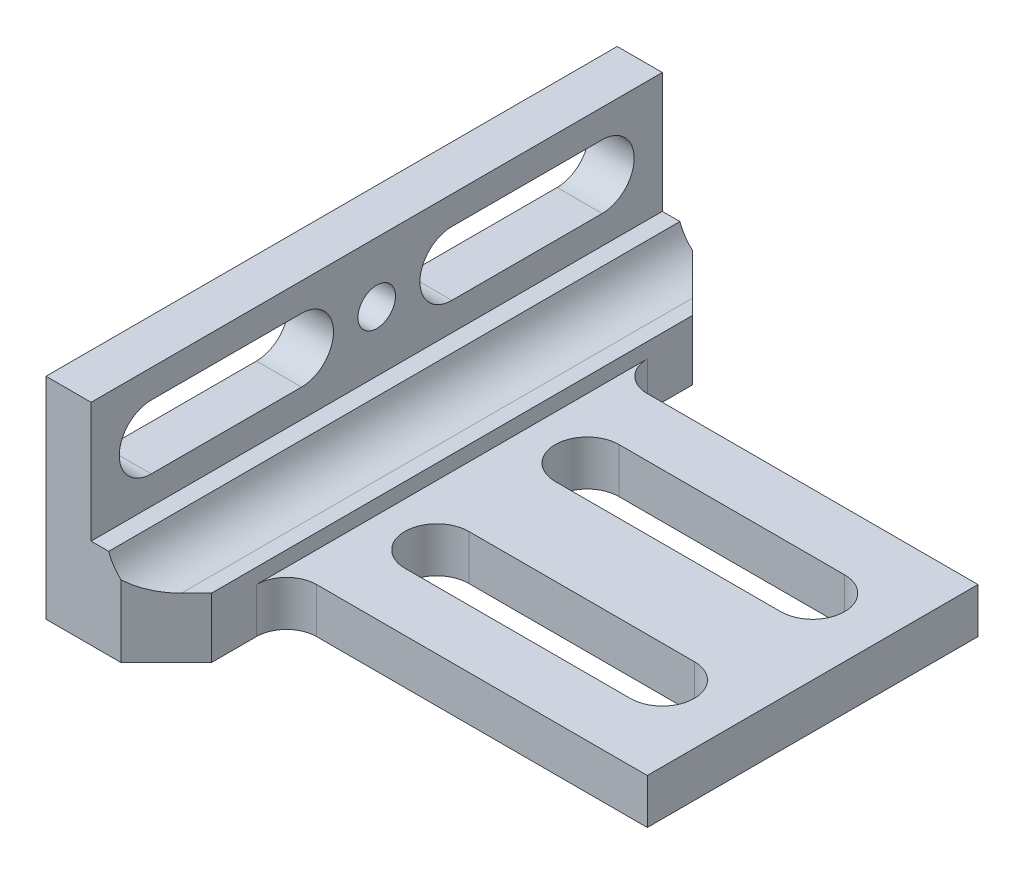
ISO-10303-21;
HEADER;
FILE_DESCRIPTION(('STEP AP214'),'2;1');
FILE_NAME('part.step','',(''),(''),'','','');
FILE_SCHEMA(('AUTOMOTIVE_DESIGN { 1 0 10303 214 1 1 1 1 }'));
ENDSEC;
DATA;
#1=APPLICATION_CONTEXT('core data for automotive mechanical design processes');
#2=APPLICATION_PROTOCOL_DEFINITION('international standard','automotive_design',2000,#1);
#3=PRODUCT_CONTEXT('',#1,'mechanical');
#4=PRODUCT('Part','Part','',(#3));
#5=PRODUCT_RELATED_PRODUCT_CATEGORY('part','',(#4));
#6=PRODUCT_DEFINITION_FORMATION('','',#4);
#7=PRODUCT_DEFINITION_CONTEXT('part definition',#1,'design');
#8=PRODUCT_DEFINITION('design','',#6,#7);
#9=PRODUCT_DEFINITION_SHAPE('','',#8);
#10=(LENGTH_UNIT() NAMED_UNIT(*) SI_UNIT(.MILLI.,.METRE.));
#11=(NAMED_UNIT(*) PLANE_ANGLE_UNIT() SI_UNIT($,.RADIAN.));
#12=(NAMED_UNIT(*) SI_UNIT($,.STERADIAN.) SOLID_ANGLE_UNIT());
#13=UNCERTAINTY_MEASURE_WITH_UNIT(LENGTH_MEASURE(1.E-05),#10,'distance_accuracy_value','');
#14=(GEOMETRIC_REPRESENTATION_CONTEXT(3) GLOBAL_UNCERTAINTY_ASSIGNED_CONTEXT((#13)) GLOBAL_UNIT_ASSIGNED_CONTEXT((#10,
#11,#12)) REPRESENTATION_CONTEXT('',''));
#15=CARTESIAN_POINT('',(0.,0.,0.));
#16=DIRECTION('',(0.,0.,1.));
#17=DIRECTION('',(1.,0.,0.));
#18=AXIS2_PLACEMENT_3D('',#15,#16,#17);
#19=CARTESIAN_POINT('',(9.52500000000001,47.625,60.325));
#20=DIRECTION('',(-1.,0.,0.));
#21=DIRECTION('',(0.,-1.,0.));
#22=AXIS2_PLACEMENT_3D('',#19,#20,#21);
#23=PLANE('',#22);
#24=CARTESIAN_POINT('',(9.525,31.75,15.875));
#25=DIRECTION('',(-1.,0.,0.));
#26=DIRECTION('',(0.,1.,0.));
#27=AXIS2_PLACEMENT_3D('',#24,#25,#26);
#28=CIRCLE('',#27,6.74687500000001);
#29=CARTESIAN_POINT('',(9.525,38.496875,15.875));
#30=VERTEX_POINT('',#29);
#31=CARTESIAN_POINT('',(9.525,25.003125,15.875));
#32=VERTEX_POINT('',#31);
#33=EDGE_CURVE('E367',#30,#32,#28,.T.);
#34=ORIENTED_EDGE('',*,*,#33,.T.);
#35=DIRECTION('',(0.,0.,1.));
#36=VECTOR('',#35,1.);
#37=CARTESIAN_POINT('',(9.525,25.003125,15.875));
#38=LINE('',#37,#36);
#39=CARTESIAN_POINT('',(9.525,25.003125,47.625));
#40=VERTEX_POINT('',#39);
#41=EDGE_CURVE('E371',#32,#40,#38,.T.);
#42=ORIENTED_EDGE('',*,*,#41,.T.);
#43=CARTESIAN_POINT('',(9.525,31.75,47.625));
#44=DIRECTION('',(-1.,0.,0.));
#45=DIRECTION('',(0.,1.,0.));
#46=AXIS2_PLACEMENT_3D('',#43,#44,#45);
#47=CIRCLE('',#46,6.74687500000001);
#48=CARTESIAN_POINT('',(9.525,38.496875,47.625));
#49=VERTEX_POINT('',#48);
#50=EDGE_CURVE('E384',#40,#49,#47,.T.);
#51=ORIENTED_EDGE('',*,*,#50,.T.);
#52=DIRECTION('',(0.,0.,-1.));
#53=VECTOR('',#52,1.);
#54=CARTESIAN_POINT('',(9.52500000000001,38.496875,15.875));
#55=LINE('',#54,#53);
#56=EDGE_CURVE('E381',#49,#30,#55,.T.);
#57=ORIENTED_EDGE('',*,*,#56,.T.);
#58=EDGE_LOOP('',(#34,#42,#51,#57));
#59=FACE_BOUND('',#58,.T.);
#60=DIRECTION('',(0.,0.,-1.));
#61=VECTOR('',#60,1.);
#62=CARTESIAN_POINT('',(9.525,25.003125,-15.875));
#63=LINE('',#62,#61);
#64=CARTESIAN_POINT('',(9.525,25.003125,-15.875));
#65=VERTEX_POINT('',#64);
#66=CARTESIAN_POINT('',(9.525,25.003125,-47.625));
#67=VERTEX_POINT('',#66);
#68=EDGE_CURVE('E414',#65,#67,#63,.T.);
#69=ORIENTED_EDGE('',*,*,#68,.F.);
#70=CARTESIAN_POINT('',(9.525,31.75,-15.875));
#71=DIRECTION('',(1.,0.,0.));
#72=DIRECTION('',(0.,1.,0.));
#73=AXIS2_PLACEMENT_3D('',#70,#71,#72);
#74=CIRCLE('',#73,6.74687500000001);
#75=CARTESIAN_POINT('',(9.52500000000001,38.496875,-15.875));
#76=VERTEX_POINT('',#75);
#77=EDGE_CURVE('E392',#76,#65,#74,.T.);
#78=ORIENTED_EDGE('',*,*,#77,.F.);
#79=DIRECTION('',(0.,0.,1.));
#80=VECTOR('',#79,1.);
#81=CARTESIAN_POINT('',(9.52500000000001,38.496875,-15.875));
#82=LINE('',#81,#80);
#83=CARTESIAN_POINT('',(9.525,38.496875,-47.625));
#84=VERTEX_POINT('',#83);
#85=EDGE_CURVE('E403',#84,#76,#82,.T.);
#86=ORIENTED_EDGE('',*,*,#85,.F.);
#87=CARTESIAN_POINT('',(9.525,31.75,-47.625));
#88=DIRECTION('',(1.,0.,0.));
#89=DIRECTION('',(0.,1.,0.));
#90=AXIS2_PLACEMENT_3D('',#87,#88,#89);
#91=CIRCLE('',#90,6.74687500000001);
#92=EDGE_CURVE('E417',#67,#84,#91,.T.);
#93=ORIENTED_EDGE('',*,*,#92,.F.);
#94=EDGE_LOOP('',(#69,#78,#86,#93));
#95=FACE_BOUND('',#94,.T.);
#96=DIRECTION('',(0.,0.,1.));
#97=VECTOR('',#96,1.);
#98=CARTESIAN_POINT('',(9.52500000000001,44.45,445.66342640527));
#99=LINE('',#98,#97);
#100=CARTESIAN_POINT('',(9.52500000000001,44.45,-60.325));
#101=VERTEX_POINT('',#100);
#102=CARTESIAN_POINT('',(9.52500000000001,44.45,60.325));
#103=VERTEX_POINT('',#102);
#104=EDGE_CURVE('E443',#101,#103,#99,.T.);
#105=ORIENTED_EDGE('',*,*,#104,.T.);
#106=DIRECTION('',(0.,1.,0.));
#107=VECTOR('',#106,1.);
#108=CARTESIAN_POINT('',(9.52500000000001,47.625,60.325));
#109=LINE('',#108,#107);
#110=CARTESIAN_POINT('',(9.525,19.05,60.325));
#111=VERTEX_POINT('',#110);
#112=EDGE_CURVE('E434',#111,#103,#109,.T.);
#113=ORIENTED_EDGE('',*,*,#112,.F.);
#114=DIRECTION('',(0.,0.,-1.));
#115=VECTOR('',#114,1.);
#116=CARTESIAN_POINT('',(9.525,19.05,60.325));
#117=LINE('',#116,#115);
#118=CARTESIAN_POINT('',(9.525,19.05,-60.325));
#119=VERTEX_POINT('',#118);
#120=EDGE_CURVE('E438',#111,#119,#117,.T.);
#121=ORIENTED_EDGE('',*,*,#120,.T.);
#122=DIRECTION('',(0.,1.,0.));
#123=VECTOR('',#122,1.);
#124=CARTESIAN_POINT('',(9.52500000000001,47.625,-60.325));
#125=LINE('',#124,#123);
#126=EDGE_CURVE('E435',#119,#101,#125,.T.);
#127=ORIENTED_EDGE('',*,*,#126,.T.);
#128=EDGE_LOOP('',(#105,#113,#121,#127));
#129=FACE_BOUND('',#128,.T.);
#130=CARTESIAN_POINT('',(9.52500000000001,31.75,0.));
#131=DIRECTION('',(1.,0.,0.));
#132=DIRECTION('',(0.,0.,-1.));
#133=AXIS2_PLACEMENT_3D('',#130,#131,#132);
#134=CIRCLE('',#133,3.96874999999999);
#135=CARTESIAN_POINT('',(9.52500000000001,31.75,-3.96874999999999));
#136=VERTEX_POINT('',#135);
#137=EDGE_CURVE('E357',#136,#136,#134,.T.);
#138=ORIENTED_EDGE('',*,*,#137,.F.);
#139=EDGE_LOOP('',(#138));
#140=FACE_BOUND('',#139,.T.);
#141=ADVANCED_FACE('F32',(#59,#95,#129,#140),#23,.F.);
#142=CARTESIAN_POINT('',(0.,0.,60.325));
#143=DIRECTION('',(1.,0.,0.));
#144=DIRECTION('',(0.,0.,-1.));
#145=AXIS2_PLACEMENT_3D('',#142,#143,#144);
#146=PLANE('',#145);
#147=CARTESIAN_POINT('',(0.,31.75,0.));
#148=DIRECTION('',(1.,0.,0.));
#149=DIRECTION('',(0.,0.,-1.));
#150=AXIS2_PLACEMENT_3D('',#147,#148,#149);
#151=CIRCLE('',#150,3.96874999999999);
#152=CARTESIAN_POINT('',(0.,31.75,-3.96874999999999));
#153=VERTEX_POINT('',#152);
#154=EDGE_CURVE('E354',#153,#153,#151,.T.);
#155=ORIENTED_EDGE('',*,*,#154,.T.);
#156=EDGE_LOOP('',(#155));
#157=FACE_BOUND('',#156,.T.);
#158=DIRECTION('',(0.,0.,1.));
#159=VECTOR('',#158,1.);
#160=CARTESIAN_POINT('',(0.,44.45,60.325));
#161=LINE('',#160,#159);
#162=CARTESIAN_POINT('',(0.,44.45,-60.325));
#163=VERTEX_POINT('',#162);
#164=CARTESIAN_POINT('',(0.,44.45,60.325));
#165=VERTEX_POINT('',#164);
#166=EDGE_CURVE('E504',#163,#165,#161,.T.);
#167=ORIENTED_EDGE('',*,*,#166,.F.);
#168=DIRECTION('',(0.,-1.,0.));
#169=VECTOR('',#168,1.);
#170=CARTESIAN_POINT('',(0.,0.,-60.325));
#171=LINE('',#170,#169);
#172=CARTESIAN_POINT('',(0.,0.,-60.325));
#173=VERTEX_POINT('',#172);
#174=EDGE_CURVE('E334',#163,#173,#171,.T.);
#175=ORIENTED_EDGE('',*,*,#174,.T.);
#176=DIRECTION('',(0.,0.,-1.));
#177=VECTOR('',#176,1.);
#178=CARTESIAN_POINT('',(0.,0.,60.325));
#179=LINE('',#178,#177);
#180=CARTESIAN_POINT('',(0.,0.,60.325));
#181=VERTEX_POINT('',#180);
#182=EDGE_CURVE('E277',#181,#173,#179,.T.);
#183=ORIENTED_EDGE('',*,*,#182,.F.);
#184=DIRECTION('',(0.,-1.,0.));
#185=VECTOR('',#184,1.);
#186=CARTESIAN_POINT('',(0.,0.,60.325));
#187=LINE('',#186,#185);
#188=EDGE_CURVE('E331',#165,#181,#187,.T.);
#189=ORIENTED_EDGE('',*,*,#188,.F.);
#190=EDGE_LOOP('',(#167,#175,#183,#189));
#191=FACE_BOUND('',#190,.T.);
#192=DIRECTION('',(0.,0.,1.));
#193=VECTOR('',#192,1.);
#194=CARTESIAN_POINT('',(0.,38.496875,-15.875));
#195=LINE('',#194,#193);
#196=CARTESIAN_POINT('',(0.,38.496875,-47.625));
#197=VERTEX_POINT('',#196);
#198=CARTESIAN_POINT('',(0.,38.496875,-15.875));
#199=VERTEX_POINT('',#198);
#200=EDGE_CURVE('E409',#197,#199,#195,.T.);
#201=ORIENTED_EDGE('',*,*,#200,.T.);
#202=CARTESIAN_POINT('',(0.,31.75,-15.875));
#203=DIRECTION('',(1.,0.,0.));
#204=DIRECTION('',(0.,1.,0.));
#205=AXIS2_PLACEMENT_3D('',#202,#203,#204);
#206=CIRCLE('',#205,6.74687500000001);
#207=CARTESIAN_POINT('',(0.,25.003125,-15.875));
#208=VERTEX_POINT('',#207);
#209=EDGE_CURVE('E399',#199,#208,#206,.T.);
#210=ORIENTED_EDGE('',*,*,#209,.T.);
#211=DIRECTION('',(0.,0.,-1.));
#212=VECTOR('',#211,1.);
#213=CARTESIAN_POINT('',(0.,25.003125,-15.875));
#214=LINE('',#213,#212);
#215=CARTESIAN_POINT('',(0.,25.003125,-47.625));
#216=VERTEX_POINT('',#215);
#217=EDGE_CURVE('E402',#208,#216,#214,.T.);
#218=ORIENTED_EDGE('',*,*,#217,.T.);
#219=CARTESIAN_POINT('',(0.,31.75,-47.625));
#220=DIRECTION('',(1.,0.,0.));
#221=DIRECTION('',(0.,1.,0.));
#222=AXIS2_PLACEMENT_3D('',#219,#220,#221);
#223=CIRCLE('',#222,6.74687500000001);
#224=EDGE_CURVE('E406',#216,#197,#223,.T.);
#225=ORIENTED_EDGE('',*,*,#224,.T.);
#226=EDGE_LOOP('',(#201,#210,#218,#225));
#227=FACE_BOUND('',#226,.T.);
#228=CARTESIAN_POINT('',(0.,31.75,15.875));
#229=DIRECTION('',(-1.,0.,0.));
#230=DIRECTION('',(0.,1.,0.));
#231=AXIS2_PLACEMENT_3D('',#228,#229,#230);
#232=CIRCLE('',#231,6.74687500000001);
#233=CARTESIAN_POINT('',(0.,38.496875,15.875));
#234=VERTEX_POINT('',#233);
#235=CARTESIAN_POINT('',(0.,25.003125,15.875));
#236=VERTEX_POINT('',#235);
#237=EDGE_CURVE('E368',#234,#236,#232,.T.);
#238=ORIENTED_EDGE('',*,*,#237,.F.);
#239=DIRECTION('',(0.,0.,-1.));
#240=VECTOR('',#239,1.);
#241=CARTESIAN_POINT('',(0.,38.496875,15.875));
#242=LINE('',#241,#240);
#243=CARTESIAN_POINT('',(0.,38.496875,47.625));
#244=VERTEX_POINT('',#243);
#245=EDGE_CURVE('E370',#244,#234,#242,.T.);
#246=ORIENTED_EDGE('',*,*,#245,.F.);
#247=CARTESIAN_POINT('',(0.,31.75,47.625));
#248=DIRECTION('',(-1.,0.,0.));
#249=DIRECTION('',(0.,1.,0.));
#250=AXIS2_PLACEMENT_3D('',#247,#248,#249);
#251=CIRCLE('',#250,6.74687500000001);
#252=CARTESIAN_POINT('',(0.,25.003125,47.625));
#253=VERTEX_POINT('',#252);
#254=EDGE_CURVE('E373',#253,#244,#251,.T.);
#255=ORIENTED_EDGE('',*,*,#254,.F.);
#256=DIRECTION('',(0.,0.,1.));
#257=VECTOR('',#256,1.);
#258=CARTESIAN_POINT('',(0.,25.003125,15.875));
#259=LINE('',#258,#257);
#260=EDGE_CURVE('E376',#236,#253,#259,.T.);
#261=ORIENTED_EDGE('',*,*,#260,.F.);
#262=EDGE_LOOP('',(#238,#246,#255,#261));
#263=FACE_BOUND('',#262,.T.);
#264=ADVANCED_FACE('F528',(#157,#191,#227,#263),#146,.F.);
#265=CARTESIAN_POINT('',(101.6,0.,60.325));
#266=DIRECTION('',(0.,1.,0.));
#267=DIRECTION('',(0.,0.,1.));
#268=AXIS2_PLACEMENT_3D('',#265,#266,#267);
#269=PLANE('',#268);
#270=DIRECTION('',(0.,0.,-1.));
#271=VECTOR('',#270,1.);
#272=CARTESIAN_POINT('',(25.4,0.,60.325));
#273=LINE('',#272,#271);
#274=CARTESIAN_POINT('',(25.4,0.,50.8));
#275=VERTEX_POINT('',#274);
#276=CARTESIAN_POINT('',(25.4,0.,41.275));
#277=VERTEX_POINT('',#276);
#278=EDGE_CURVE('E255',#275,#277,#273,.T.);
#279=ORIENTED_EDGE('',*,*,#278,.F.);
#280=DIRECTION('',(0.707106781186546,0.,-0.707106781186549));
#281=VECTOR('',#280,1.);
#282=CARTESIAN_POINT('',(15.875,0.,60.325));
#283=LINE('',#282,#281);
#284=CARTESIAN_POINT('',(15.875,0.,60.325));
#285=VERTEX_POINT('',#284);
#286=EDGE_CURVE('E40',#275,#285,#283,.F.);
#287=ORIENTED_EDGE('',*,*,#286,.T.);
#288=DIRECTION('',(1.,0.,0.));
#289=VECTOR('',#288,1.);
#290=CARTESIAN_POINT('',(101.6,0.,60.325));
#291=LINE('',#290,#289);
#292=EDGE_CURVE('E323',#181,#285,#291,.T.);
#293=ORIENTED_EDGE('',*,*,#292,.F.);
#294=ORIENTED_EDGE('',*,*,#182,.T.);
#295=DIRECTION('',(1.,0.,0.));
#296=VECTOR('',#295,1.);
#297=CARTESIAN_POINT('',(101.6,0.,-60.325));
#298=LINE('',#297,#296);
#299=CARTESIAN_POINT('',(15.875,0.,-60.325));
#300=VERTEX_POINT('',#299);
#301=EDGE_CURVE('E516',#173,#300,#298,.T.);
#302=ORIENTED_EDGE('',*,*,#301,.T.);
#303=DIRECTION('',(0.707106781186548,0.,0.707106781186547));
#304=VECTOR('',#303,1.);
#305=CARTESIAN_POINT('',(25.4,0.,-50.8));
#306=LINE('',#305,#304);
#307=CARTESIAN_POINT('',(25.4,0.,-50.8));
#308=VERTEX_POINT('',#307);
#309=EDGE_CURVE('E318',#300,#308,#306,.T.);
#310=ORIENTED_EDGE('',*,*,#309,.T.);
#311=DIRECTION('',(0.,0.,-1.));
#312=VECTOR('',#311,1.);
#313=CARTESIAN_POINT('',(25.4,0.,-60.325));
#314=LINE('',#313,#312);
#315=CARTESIAN_POINT('',(25.4,0.,-41.275));
#316=VERTEX_POINT('',#315);
#317=EDGE_CURVE('E352',#316,#308,#314,.T.);
#318=ORIENTED_EDGE('',*,*,#317,.F.);
#319=CARTESIAN_POINT('',(31.75,0.,-41.275));
#320=DIRECTION('',(0.,1.,0.));
#321=DIRECTION('',(0.,0.,1.));
#322=AXIS2_PLACEMENT_3D('',#319,#320,#321);
#323=CIRCLE('',#322,6.35);
#324=CARTESIAN_POINT('',(31.75,0.,-34.925));
#325=VERTEX_POINT('',#324);
#326=EDGE_CURVE('E294',#316,#325,#323,.T.);
#327=ORIENTED_EDGE('',*,*,#326,.T.);
#328=DIRECTION('',(1.,0.,0.));
#329=VECTOR('',#328,1.);
#330=CARTESIAN_POINT('',(-1.72721189138315,0.,-34.925));
#331=LINE('',#330,#329);
#332=CARTESIAN_POINT('',(101.6,0.,-34.925));
#333=VERTEX_POINT('',#332);
#334=EDGE_CURVE('E269',#325,#333,#331,.T.);
#335=ORIENTED_EDGE('',*,*,#334,.T.);
#336=DIRECTION('',(0.,0.,-1.));
#337=VECTOR('',#336,1.);
#338=CARTESIAN_POINT('',(101.6,0.,60.325));
#339=LINE('',#338,#337);
#340=CARTESIAN_POINT('',(101.6,0.,34.925));
#341=VERTEX_POINT('',#340);
#342=EDGE_CURVE('E261',#341,#333,#339,.T.);
#343=ORIENTED_EDGE('',*,*,#342,.F.);
#344=DIRECTION('',(1.,0.,0.));
#345=VECTOR('',#344,1.);
#346=CARTESIAN_POINT('',(-1.72721189138315,0.,34.925));
#347=LINE('',#346,#345);
#348=CARTESIAN_POINT('',(31.75,0.,34.925));
#349=VERTEX_POINT('',#348);
#350=EDGE_CURVE('E242',#349,#341,#347,.T.);
#351=ORIENTED_EDGE('',*,*,#350,.F.);
#352=CARTESIAN_POINT('',(31.75,0.,41.275));
#353=DIRECTION('',(0.,1.,0.));
#354=DIRECTION('',(0.,0.,1.));
#355=AXIS2_PLACEMENT_3D('',#352,#353,#354);
#356=CIRCLE('',#355,6.35);
#357=EDGE_CURVE('E301',#349,#277,#356,.T.);
#358=ORIENTED_EDGE('',*,*,#357,.T.);
#359=EDGE_LOOP('',(#279,#287,#293,#294,#302,#310,#318,#327,#335,#343,#351,#358));
#360=FACE_BOUND('',#359,.T.);
#361=DIRECTION('',(1.,0.,0.));
#362=VECTOR('',#361,1.);
#363=CARTESIAN_POINT('',(38.1,0.,-9.12875999999999));
#364=LINE('',#363,#362);
#365=CARTESIAN_POINT('',(38.1,0.,-9.12875999999999));
#366=VERTEX_POINT('',#365);
#367=CARTESIAN_POINT('',(85.725,0.,-9.12876));
#368=VERTEX_POINT('',#367);
#369=EDGE_CURVE('E497',#366,#368,#364,.T.);
#370=ORIENTED_EDGE('',*,*,#369,.T.);
#371=CARTESIAN_POINT('',(85.725,0.,-15.875));
#372=DIRECTION('',(0.,1.,0.));
#373=DIRECTION('',(0.,0.,1.));
#374=AXIS2_PLACEMENT_3D('',#371,#372,#373);
#375=CIRCLE('',#374,6.74624);
#376=CARTESIAN_POINT('',(85.725,0.,-22.62124));
#377=VERTEX_POINT('',#376);
#378=EDGE_CURVE('E480',#368,#377,#375,.T.);
#379=ORIENTED_EDGE('',*,*,#378,.T.);
#380=DIRECTION('',(-1.,0.,0.));
#381=VECTOR('',#380,1.);
#382=CARTESIAN_POINT('',(85.725,0.,-22.62124));
#383=LINE('',#382,#381);
#384=CARTESIAN_POINT('',(38.1,0.,-22.62124));
#385=VERTEX_POINT('',#384);
#386=EDGE_CURVE('E491',#377,#385,#383,.T.);
#387=ORIENTED_EDGE('',*,*,#386,.T.);
#388=CARTESIAN_POINT('',(38.1,0.,-15.875));
#389=DIRECTION('',(0.,1.,0.));
#390=DIRECTION('',(0.,0.,1.));
#391=AXIS2_PLACEMENT_3D('',#388,#389,#390);
#392=CIRCLE('',#391,6.74624000000001);
#393=EDGE_CURVE('E494',#385,#366,#392,.T.);
#394=ORIENTED_EDGE('',*,*,#393,.T.);
#395=EDGE_LOOP('',(#370,#379,#387,#394));
#396=FACE_BOUND('',#395,.T.);
#397=CARTESIAN_POINT('',(85.725,0.,15.875));
#398=DIRECTION('',(0.,-1.,0.));
#399=DIRECTION('',(0.,0.,-1.));
#400=AXIS2_PLACEMENT_3D('',#397,#398,#399);
#401=CIRCLE('',#400,6.74624);
#402=CARTESIAN_POINT('',(85.725,0.,9.12876));
#403=VERTEX_POINT('',#402);
#404=CARTESIAN_POINT('',(85.725,0.,22.62124));
#405=VERTEX_POINT('',#404);
#406=EDGE_CURVE('E467',#403,#405,#401,.T.);
#407=ORIENTED_EDGE('',*,*,#406,.F.);
#408=DIRECTION('',(1.,0.,0.));
#409=VECTOR('',#408,1.);
#410=CARTESIAN_POINT('',(38.1,0.,9.12875999999999));
#411=LINE('',#410,#409);
#412=CARTESIAN_POINT('',(38.1,0.,9.12875999999999));
#413=VERTEX_POINT('',#412);
#414=EDGE_CURVE('E469',#413,#403,#411,.T.);
#415=ORIENTED_EDGE('',*,*,#414,.F.);
#416=CARTESIAN_POINT('',(38.1,0.,15.875));
#417=DIRECTION('',(0.,-1.,0.));
#418=DIRECTION('',(0.,0.,-1.));
#419=AXIS2_PLACEMENT_3D('',#416,#417,#418);
#420=CIRCLE('',#419,6.74624000000001);
#421=CARTESIAN_POINT('',(38.1,0.,22.62124));
#422=VERTEX_POINT('',#421);
#423=EDGE_CURVE('E471',#422,#413,#420,.T.);
#424=ORIENTED_EDGE('',*,*,#423,.F.);
#425=DIRECTION('',(-1.,0.,0.));
#426=VECTOR('',#425,1.);
#427=CARTESIAN_POINT('',(85.725,0.,22.62124));
#428=LINE('',#427,#426);
#429=EDGE_CURVE('E474',#405,#422,#428,.T.);
#430=ORIENTED_EDGE('',*,*,#429,.F.);
#431=EDGE_LOOP('',(#407,#415,#424,#430));
#432=FACE_BOUND('',#431,.T.);
#433=ADVANCED_FACE('F266',(#360,#396,#432),#269,.F.);
#434=CARTESIAN_POINT('',(22.225,12.7,60.325));
#435=DIRECTION('',(0.,-1.,0.));
#436=DIRECTION('',(0.,0.,-1.));
#437=AXIS2_PLACEMENT_3D('',#434,#435,#436);
#438=PLANE('',#437);
#439=DIRECTION('',(0.,0.,-1.));
#440=VECTOR('',#439,1.);
#441=CARTESIAN_POINT('',(22.225,12.7,60.325));
#442=LINE('',#441,#440);
#443=CARTESIAN_POINT('',(22.225,12.7,53.975));
#444=VERTEX_POINT('',#443);
#445=CARTESIAN_POINT('',(22.225,12.7,-53.975));
#446=VERTEX_POINT('',#445);
#447=EDGE_CURVE('E271',#444,#446,#442,.T.);
#448=ORIENTED_EDGE('',*,*,#447,.F.);
#449=DIRECTION('',(-0.707106781186546,0.,0.707106781186549));
#450=VECTOR('',#449,1.);
#451=CARTESIAN_POINT('',(15.875,12.7,60.325));
#452=LINE('',#451,#450);
#453=CARTESIAN_POINT('',(25.4,12.7,50.8));
#454=VERTEX_POINT('',#453);
#455=EDGE_CURVE('E312',#444,#454,#452,.F.);
#456=ORIENTED_EDGE('',*,*,#455,.T.);
#457=DIRECTION('',(0.,0.,-1.));
#458=VECTOR('',#457,1.);
#459=CARTESIAN_POINT('',(25.4,12.7,60.325));
#460=LINE('',#459,#458);
#461=CARTESIAN_POINT('',(25.4,12.7,-50.8));
#462=VERTEX_POINT('',#461);
#463=EDGE_CURVE('E345',#454,#462,#460,.T.);
#464=ORIENTED_EDGE('',*,*,#463,.T.);
#465=DIRECTION('',(-0.707106781186548,0.,-0.707106781186547));
#466=VECTOR('',#465,1.);
#467=CARTESIAN_POINT('',(25.4,12.7,-50.8));
#468=LINE('',#467,#466);
#469=EDGE_CURVE('E310',#462,#446,#468,.T.);
#470=ORIENTED_EDGE('',*,*,#469,.T.);
#471=EDGE_LOOP('',(#448,#456,#464,#470));
#472=FACE_BOUND('',#471,.T.);
#473=ADVANCED_FACE('F343',(#472),#438,.F.);
#474=CARTESIAN_POINT('',(-4.11227174887305,44.45,445.66342640527));
#475=DIRECTION('',(0.,1.,0.));
#476=DIRECTION('',(0.,0.,1.));
#477=AXIS2_PLACEMENT_3D('',#474,#475,#476);
#478=PLANE('',#477);
#479=ORIENTED_EDGE('',*,*,#104,.F.);
#480=DIRECTION('',(1.,0.,0.));
#481=VECTOR('',#480,1.);
#482=CARTESIAN_POINT('',(3.18008,44.45,-60.325));
#483=LINE('',#482,#481);
#484=EDGE_CURVE('E270',#163,#101,#483,.T.);
#485=ORIENTED_EDGE('',*,*,#484,.F.);
#486=ORIENTED_EDGE('',*,*,#166,.T.);
#487=DIRECTION('',(1.,0.,0.));
#488=VECTOR('',#487,1.);
#489=CARTESIAN_POINT('',(3.18008,44.45,60.325));
#490=LINE('',#489,#488);
#491=EDGE_CURVE('E514',#165,#103,#490,.T.);
#492=ORIENTED_EDGE('',*,*,#491,.T.);
#493=EDGE_LOOP('',(#479,#485,#486,#492));
#494=FACE_BOUND('',#493,.T.);
#495=ADVANCED_FACE('F532',(#494),#478,.T.);
#496=CARTESIAN_POINT('',(3.18008,92.08008,60.325));
#497=DIRECTION('',(0.,0.,-1.));
#498=DIRECTION('',(-1.,0.,0.));
#499=AXIS2_PLACEMENT_3D('',#496,#497,#498);
#500=PLANE('',#499);
#501=ORIENTED_EDGE('',*,*,#292,.T.);
#502=DIRECTION('',(0.,1.,0.));
#503=VECTOR('',#502,1.);
#504=CARTESIAN_POINT('',(15.875,92.08008,60.325));
#505=LINE('',#504,#503);
#506=CARTESIAN_POINT('',(15.875,15.1254841714381,60.325));
#507=VERTEX_POINT('',#506);
#508=EDGE_CURVE('E303',#285,#507,#505,.T.);
#509=ORIENTED_EDGE('',*,*,#508,.T.);
#510=CARTESIAN_POINT('',(22.225,22.225,60.325));
#511=DIRECTION('',(0.,0.,-1.));
#512=DIRECTION('',(-1.,0.,0.));
#513=AXIS2_PLACEMENT_3D('',#510,#511,#512);
#514=CIRCLE('',#513,9.525);
#515=CARTESIAN_POINT('',(13.2447438789309,19.05,60.325));
#516=VERTEX_POINT('',#515);
#517=EDGE_CURVE('E333',#507,#516,#514,.T.);
#518=ORIENTED_EDGE('',*,*,#517,.T.);
#519=DIRECTION('',(-1.,0.,0.));
#520=VECTOR('',#519,1.);
#521=CARTESIAN_POINT('',(19.05,19.05,60.325));
#522=LINE('',#521,#520);
#523=EDGE_CURVE('E431',#516,#111,#522,.T.);
#524=ORIENTED_EDGE('',*,*,#523,.T.);
#525=ORIENTED_EDGE('',*,*,#112,.T.);
#526=ORIENTED_EDGE('',*,*,#491,.F.);
#527=ORIENTED_EDGE('',*,*,#188,.T.);
#528=EDGE_LOOP('',(#501,#509,#518,#524,#525,#526,#527));
#529=FACE_BOUND('',#528,.T.);
#530=ADVANCED_FACE('F327',(#529),#500,.F.);
#531=CARTESIAN_POINT('',(3.18008,92.08008,-60.325));
#532=DIRECTION('',(0.,0.,-1.));
#533=DIRECTION('',(-1.,0.,0.));
#534=AXIS2_PLACEMENT_3D('',#531,#532,#533);
#535=PLANE('',#534);
#536=CARTESIAN_POINT('',(22.225,22.225,-60.325));
#537=DIRECTION('',(0.,0.,-1.));
#538=DIRECTION('',(-1.,0.,0.));
#539=AXIS2_PLACEMENT_3D('',#536,#537,#538);
#540=CIRCLE('',#539,9.525);
#541=CARTESIAN_POINT('',(15.875,15.1254841714382,-60.325));
#542=VERTEX_POINT('',#541);
#543=CARTESIAN_POINT('',(13.2447438789309,19.05,-60.325));
#544=VERTEX_POINT('',#543);
#545=EDGE_CURVE('E521',#542,#544,#540,.T.);
#546=ORIENTED_EDGE('',*,*,#545,.F.);
#547=DIRECTION('',(0.,-1.,0.));
#548=VECTOR('',#547,1.);
#549=CARTESIAN_POINT('',(15.875,0.,-60.325));
#550=LINE('',#549,#548);
#551=EDGE_CURVE('E11',#542,#300,#550,.T.);
#552=ORIENTED_EDGE('',*,*,#551,.T.);
#553=ORIENTED_EDGE('',*,*,#301,.F.);
#554=ORIENTED_EDGE('',*,*,#174,.F.);
#555=ORIENTED_EDGE('',*,*,#484,.T.);
#556=ORIENTED_EDGE('',*,*,#126,.F.);
#557=DIRECTION('',(-1.,0.,0.));
#558=VECTOR('',#557,1.);
#559=CARTESIAN_POINT('',(19.05,19.05,-60.325));
#560=LINE('',#559,#558);
#561=EDGE_CURVE('E424',#544,#119,#560,.T.);
#562=ORIENTED_EDGE('',*,*,#561,.F.);
#563=EDGE_LOOP('',(#546,#552,#553,#554,#555,#556,#562));
#564=FACE_BOUND('',#563,.T.);
#565=ADVANCED_FACE('F525',(#564),#535,.T.);
#566=CARTESIAN_POINT('',(101.6,12.7,60.325));
#567=DIRECTION('',(-1.,0.,0.));
#568=DIRECTION('',(0.,0.,1.));
#569=AXIS2_PLACEMENT_3D('',#566,#567,#568);
#570=PLANE('',#569);
#571=DIRECTION('',(0.,0.,-1.));
#572=VECTOR('',#571,1.);
#573=CARTESIAN_POINT('',(101.6,9.525,60.325));
#574=LINE('',#573,#572);
#575=CARTESIAN_POINT('',(101.6,9.525,34.925));
#576=VERTEX_POINT('',#575);
#577=CARTESIAN_POINT('',(101.6,9.525,-34.925));
#578=VERTEX_POINT('',#577);
#579=EDGE_CURVE('E264',#576,#578,#574,.T.);
#580=ORIENTED_EDGE('',*,*,#579,.F.);
#581=DIRECTION('',(0.,1.,0.));
#582=VECTOR('',#581,1.);
#583=CARTESIAN_POINT('',(101.6,0.,34.925));
#584=LINE('',#583,#582);
#585=EDGE_CURVE('E246',#341,#576,#584,.T.);
#586=ORIENTED_EDGE('',*,*,#585,.F.);
#587=ORIENTED_EDGE('',*,*,#342,.T.);
#588=DIRECTION('',(0.,-1.,0.));
#589=VECTOR('',#588,1.);
#590=CARTESIAN_POINT('',(101.6,0.,-34.925));
#591=LINE('',#590,#589);
#592=EDGE_CURVE('E362',#578,#333,#591,.T.);
#593=ORIENTED_EDGE('',*,*,#592,.F.);
#594=EDGE_LOOP('',(#580,#586,#587,#593));
#595=FACE_BOUND('',#594,.T.);
#596=ADVANCED_FACE('F259',(#595),#570,.F.);
#597=CARTESIAN_POINT('',(22.225,22.225,60.325));
#598=DIRECTION('',(0.,0.,-1.));
#599=DIRECTION('',(-1.,0.,0.));
#600=AXIS2_PLACEMENT_3D('',#597,#598,#599);
#601=CYLINDRICAL_SURFACE('',#600,9.525);
#602=ORIENTED_EDGE('',*,*,#517,.F.);
#603=CARTESIAN_POINT('',(22.225,22.225,53.975));
#604=DIRECTION('',(-0.707106781186549,0.,-0.707106781186546));
#605=DIRECTION('',(0.707106781186546,0.,-0.707106781186549));
#606=AXIS2_PLACEMENT_3D('',#603,#604,#605);
#607=ELLIPSE('',#606,13.4703841816038,9.525);
#608=EDGE_CURVE('E308',#507,#444,#607,.F.);
#609=ORIENTED_EDGE('',*,*,#608,.T.);
#610=ORIENTED_EDGE('',*,*,#447,.T.);
#611=CARTESIAN_POINT('',(22.225,22.225,-53.975));
#612=DIRECTION('',(0.707106781186547,0.,-0.707106781186548));
#613=DIRECTION('',(-0.707106781186548,0.,-0.707106781186547));
#614=AXIS2_PLACEMENT_3D('',#611,#612,#613);
#615=ELLIPSE('',#614,13.4703841816037,9.525);
#616=EDGE_CURVE('E306',#446,#542,#615,.T.);
#617=ORIENTED_EDGE('',*,*,#616,.T.);
#618=ORIENTED_EDGE('',*,*,#545,.T.);
#619=DIRECTION('',(0.,0.,-1.));
#620=VECTOR('',#619,1.);
#621=CARTESIAN_POINT('',(13.2447438789309,19.05,60.325));
#622=LINE('',#621,#620);
#623=EDGE_CURVE('E282',#544,#516,#622,.F.);
#624=ORIENTED_EDGE('',*,*,#623,.T.);
#625=EDGE_LOOP('',(#602,#609,#610,#617,#618,#624));
#626=FACE_BOUND('',#625,.T.);
#627=ADVANCED_FACE('F340',(#626),#601,.F.);
#628=CARTESIAN_POINT('',(85.725,0.,-15.875));
#629=DIRECTION('',(0.,1.,0.));
#630=DIRECTION('',(0.,0.,1.));
#631=AXIS2_PLACEMENT_3D('',#628,#629,#630);
#632=CYLINDRICAL_SURFACE('',#631,6.74624);
#633=DIRECTION('',(0.,1.,0.));
#634=VECTOR('',#633,1.);
#635=CARTESIAN_POINT('',(85.725,0.,-9.12876));
#636=LINE('',#635,#634);
#637=CARTESIAN_POINT('',(85.725,9.525,-9.12876));
#638=VERTEX_POINT('',#637);
#639=EDGE_CURVE('E501',#368,#638,#636,.T.);
#640=ORIENTED_EDGE('',*,*,#639,.T.);
#641=CARTESIAN_POINT('',(85.725,9.525,-15.875));
#642=DIRECTION('',(0.,-1.,0.));
#643=DIRECTION('',(0.,0.,-1.));
#644=AXIS2_PLACEMENT_3D('',#641,#642,#643);
#645=CIRCLE('',#644,6.74624);
#646=CARTESIAN_POINT('',(85.725,9.525,-22.62124));
#647=VERTEX_POINT('',#646);
#648=EDGE_CURVE('E463',#638,#647,#645,.F.);
#649=ORIENTED_EDGE('',*,*,#648,.T.);
#650=DIRECTION('',(0.,1.,0.));
#651=VECTOR('',#650,1.);
#652=CARTESIAN_POINT('',(85.725,0.,-22.62124));
#653=LINE('',#652,#651);
#654=EDGE_CURVE('E500',#377,#647,#653,.T.);
#655=ORIENTED_EDGE('',*,*,#654,.F.);
#656=ORIENTED_EDGE('',*,*,#378,.F.);
#657=EDGE_LOOP('',(#640,#649,#655,#656));
#658=FACE_BOUND('',#657,.T.);
#659=ADVANCED_FACE('F648',(#658),#632,.F.);
#660=CARTESIAN_POINT('',(38.1,0.,-9.12875999999999));
#661=DIRECTION('',(0.,0.,1.));
#662=DIRECTION('',(1.,0.,0.));
#663=AXIS2_PLACEMENT_3D('',#660,#661,#662);
#664=PLANE('',#663);
#665=DIRECTION('',(0.,1.,0.));
#666=VECTOR('',#665,1.);
#667=CARTESIAN_POINT('',(38.1,0.,-9.12875999999999));
#668=LINE('',#667,#666);
#669=CARTESIAN_POINT('',(38.1,9.525,-9.12875999999999));
#670=VERTEX_POINT('',#669);
#671=EDGE_CURVE('E505',#366,#670,#668,.T.);
#672=ORIENTED_EDGE('',*,*,#671,.T.);
#673=DIRECTION('',(1.,0.,0.));
#674=VECTOR('',#673,1.);
#675=CARTESIAN_POINT('',(38.1,9.525,-9.12875999999999));
#676=LINE('',#675,#674);
#677=EDGE_CURVE('E460',#670,#638,#676,.T.);
#678=ORIENTED_EDGE('',*,*,#677,.T.);
#679=ORIENTED_EDGE('',*,*,#639,.F.);
#680=ORIENTED_EDGE('',*,*,#369,.F.);
#681=EDGE_LOOP('',(#672,#678,#679,#680));
#682=FACE_BOUND('',#681,.T.);
#683=ADVANCED_FACE('F845',(#682),#664,.F.);
#684=CARTESIAN_POINT('',(38.1,0.,-15.875));
#685=DIRECTION('',(0.,1.,0.));
#686=DIRECTION('',(0.,0.,1.));
#687=AXIS2_PLACEMENT_3D('',#684,#685,#686);
#688=CYLINDRICAL_SURFACE('',#687,6.74624000000001);
#689=DIRECTION('',(0.,1.,0.));
#690=VECTOR('',#689,1.);
#691=CARTESIAN_POINT('',(38.1,0.,-22.62124));
#692=LINE('',#691,#690);
#693=CARTESIAN_POINT('',(38.1,9.525,-22.62124));
#694=VERTEX_POINT('',#693);
#695=EDGE_CURVE('E508',#385,#694,#692,.T.);
#696=ORIENTED_EDGE('',*,*,#695,.T.);
#697=CARTESIAN_POINT('',(38.1,9.525,-15.875));
#698=DIRECTION('',(0.,-1.,0.));
#699=DIRECTION('',(0.,0.,-1.));
#700=AXIS2_PLACEMENT_3D('',#697,#698,#699);
#701=CIRCLE('',#700,6.74624000000001);
#702=EDGE_CURVE('E457',#694,#670,#701,.F.);
#703=ORIENTED_EDGE('',*,*,#702,.T.);
#704=ORIENTED_EDGE('',*,*,#671,.F.);
#705=ORIENTED_EDGE('',*,*,#393,.F.);
#706=EDGE_LOOP('',(#696,#703,#704,#705));
#707=FACE_BOUND('',#706,.T.);
#708=ADVANCED_FACE('F835',(#707),#688,.F.);
#709=CARTESIAN_POINT('',(85.725,0.,-22.62124));
#710=DIRECTION('',(0.,0.,-1.));
#711=DIRECTION('',(-1.,0.,0.));
#712=AXIS2_PLACEMENT_3D('',#709,#710,#711);
#713=PLANE('',#712);
#714=ORIENTED_EDGE('',*,*,#654,.T.);
#715=DIRECTION('',(-1.,0.,0.));
#716=VECTOR('',#715,1.);
#717=CARTESIAN_POINT('',(85.725,9.525,-22.62124));
#718=LINE('',#717,#716);
#719=EDGE_CURVE('E454',#647,#694,#718,.T.);
#720=ORIENTED_EDGE('',*,*,#719,.T.);
#721=ORIENTED_EDGE('',*,*,#695,.F.);
#722=ORIENTED_EDGE('',*,*,#386,.F.);
#723=EDGE_LOOP('',(#714,#720,#721,#722));
#724=FACE_BOUND('',#723,.T.);
#725=ADVANCED_FACE('F826',(#724),#713,.F.);
#726=CARTESIAN_POINT('',(85.725,0.,15.875));
#727=DIRECTION('',(0.,1.,0.));
#728=DIRECTION('',(0.,0.,1.));
#729=AXIS2_PLACEMENT_3D('',#726,#727,#728);
#730=CYLINDRICAL_SURFACE('',#729,6.74624);
#731=CARTESIAN_POINT('',(85.725,9.525,15.875));
#732=DIRECTION('',(0.,-1.,0.));
#733=DIRECTION('',(0.,0.,-1.));
#734=AXIS2_PLACEMENT_3D('',#731,#732,#733);
#735=CIRCLE('',#734,6.74624);
#736=CARTESIAN_POINT('',(85.725,9.525,9.12876));
#737=VERTEX_POINT('',#736);
#738=CARTESIAN_POINT('',(85.725,9.525,22.62124));
#739=VERTEX_POINT('',#738);
#740=EDGE_CURVE('E452',#737,#739,#735,.T.);
#741=ORIENTED_EDGE('',*,*,#740,.F.);
#742=DIRECTION('',(0.,1.,0.));
#743=VECTOR('',#742,1.);
#744=CARTESIAN_POINT('',(85.725,0.,9.12876));
#745=LINE('',#744,#743);
#746=EDGE_CURVE('E476',#403,#737,#745,.T.);
#747=ORIENTED_EDGE('',*,*,#746,.F.);
#748=ORIENTED_EDGE('',*,*,#406,.T.);
#749=DIRECTION('',(0.,1.,0.));
#750=VECTOR('',#749,1.);
#751=CARTESIAN_POINT('',(85.725,0.,22.62124));
#752=LINE('',#751,#750);
#753=EDGE_CURVE('E477',#405,#739,#752,.T.);
#754=ORIENTED_EDGE('',*,*,#753,.T.);
#755=EDGE_LOOP('',(#741,#747,#748,#754));
#756=FACE_BOUND('',#755,.T.);
#757=ADVANCED_FACE('F817',(#756),#730,.F.);
#758=CARTESIAN_POINT('',(85.725,0.,22.62124));
#759=DIRECTION('',(0.,0.,-1.));
#760=DIRECTION('',(-1.,0.,0.));
#761=AXIS2_PLACEMENT_3D('',#758,#759,#760);
#762=PLANE('',#761);
#763=DIRECTION('',(-1.,0.,0.));
#764=VECTOR('',#763,1.);
#765=CARTESIAN_POINT('',(85.725,9.525,22.62124));
#766=LINE('',#765,#764);
#767=CARTESIAN_POINT('',(38.1,9.525,22.62124));
#768=VERTEX_POINT('',#767);
#769=EDGE_CURVE('E450',#739,#768,#766,.T.);
#770=ORIENTED_EDGE('',*,*,#769,.F.);
#771=ORIENTED_EDGE('',*,*,#753,.F.);
#772=ORIENTED_EDGE('',*,*,#429,.T.);
#773=DIRECTION('',(0.,1.,0.));
#774=VECTOR('',#773,1.);
#775=CARTESIAN_POINT('',(38.1,0.,22.62124));
#776=LINE('',#775,#774);
#777=EDGE_CURVE('E481',#422,#768,#776,.T.);
#778=ORIENTED_EDGE('',*,*,#777,.T.);
#779=EDGE_LOOP('',(#770,#771,#772,#778));
#780=FACE_BOUND('',#779,.T.);
#781=ADVANCED_FACE('F807',(#780),#762,.T.);
#782=CARTESIAN_POINT('',(38.1,0.,15.875));
#783=DIRECTION('',(0.,1.,0.));
#784=DIRECTION('',(0.,0.,1.));
#785=AXIS2_PLACEMENT_3D('',#782,#783,#784);
#786=CYLINDRICAL_SURFACE('',#785,6.74624000000001);
#787=CARTESIAN_POINT('',(38.1,9.525,15.875));
#788=DIRECTION('',(0.,-1.,0.));
#789=DIRECTION('',(0.,0.,-1.));
#790=AXIS2_PLACEMENT_3D('',#787,#788,#789);
#791=CIRCLE('',#790,6.74624000000001);
#792=CARTESIAN_POINT('',(38.1,9.525,9.12875999999999));
#793=VERTEX_POINT('',#792);
#794=EDGE_CURVE('E447',#768,#793,#791,.T.);
#795=ORIENTED_EDGE('',*,*,#794,.F.);
#796=ORIENTED_EDGE('',*,*,#777,.F.);
#797=ORIENTED_EDGE('',*,*,#423,.T.);
#798=DIRECTION('',(0.,1.,0.));
#799=VECTOR('',#798,1.);
#800=CARTESIAN_POINT('',(38.1,0.,9.12875999999999));
#801=LINE('',#800,#799);
#802=EDGE_CURVE('E484',#413,#793,#801,.T.);
#803=ORIENTED_EDGE('',*,*,#802,.T.);
#804=EDGE_LOOP('',(#795,#796,#797,#803));
#805=FACE_BOUND('',#804,.T.);
#806=ADVANCED_FACE('F797',(#805),#786,.F.);
#807=CARTESIAN_POINT('',(38.1,0.,9.12875999999999));
#808=DIRECTION('',(0.,0.,1.));
#809=DIRECTION('',(1.,0.,0.));
#810=AXIS2_PLACEMENT_3D('',#807,#808,#809);
#811=PLANE('',#810);
#812=DIRECTION('',(1.,0.,0.));
#813=VECTOR('',#812,1.);
#814=CARTESIAN_POINT('',(38.1,9.525,9.12875999999999));
#815=LINE('',#814,#813);
#816=EDGE_CURVE('E274',#793,#737,#815,.T.);
#817=ORIENTED_EDGE('',*,*,#816,.F.);
#818=ORIENTED_EDGE('',*,*,#802,.F.);
#819=ORIENTED_EDGE('',*,*,#414,.T.);
#820=ORIENTED_EDGE('',*,*,#746,.T.);
#821=EDGE_LOOP('',(#817,#818,#819,#820));
#822=FACE_BOUND('',#821,.T.);
#823=ADVANCED_FACE('F636',(#822),#811,.T.);
#824=CARTESIAN_POINT('',(25.4,15.875,60.325));
#825=DIRECTION('',(-1.,0.,0.));
#826=DIRECTION('',(0.,0.,1.));
#827=AXIS2_PLACEMENT_3D('',#824,#825,#826);
#828=PLANE('',#827);
#829=ORIENTED_EDGE('',*,*,#463,.F.);
#830=DIRECTION('',(0.,-1.,0.));
#831=VECTOR('',#830,1.);
#832=CARTESIAN_POINT('',(25.4,15.875,50.8));
#833=LINE('',#832,#831);
#834=EDGE_CURVE('E53',#454,#275,#833,.T.);
#835=ORIENTED_EDGE('',*,*,#834,.T.);
#836=ORIENTED_EDGE('',*,*,#278,.T.);
#837=DIRECTION('',(0.,1.,0.));
#838=VECTOR('',#837,1.);
#839=CARTESIAN_POINT('',(25.4,9.525,41.275));
#840=LINE('',#839,#838);
#841=CARTESIAN_POINT('',(25.4,9.525,41.275));
#842=VERTEX_POINT('',#841);
#843=EDGE_CURVE('E285',#277,#842,#840,.T.);
#844=ORIENTED_EDGE('',*,*,#843,.T.);
#845=DIRECTION('',(0.,0.,-1.));
#846=VECTOR('',#845,1.);
#847=CARTESIAN_POINT('',(25.4,9.525,60.325));
#848=LINE('',#847,#846);
#849=CARTESIAN_POINT('',(25.4,9.525,-41.275));
#850=VERTEX_POINT('',#849);
#851=EDGE_CURVE('E445',#842,#850,#848,.T.);
#852=ORIENTED_EDGE('',*,*,#851,.T.);
#853=DIRECTION('',(0.,-1.,0.));
#854=VECTOR('',#853,1.);
#855=CARTESIAN_POINT('',(25.4,0.,-41.275));
#856=LINE('',#855,#854);
#857=EDGE_CURVE('E288',#850,#316,#856,.T.);
#858=ORIENTED_EDGE('',*,*,#857,.T.);
#859=ORIENTED_EDGE('',*,*,#317,.T.);
#860=DIRECTION('',(0.,1.,0.));
#861=VECTOR('',#860,1.);
#862=CARTESIAN_POINT('',(25.4,12.7,-50.8));
#863=LINE('',#862,#861);
#864=EDGE_CURVE('E314',#308,#462,#863,.T.);
#865=ORIENTED_EDGE('',*,*,#864,.T.);
#866=EDGE_LOOP('',(#829,#835,#836,#844,#852,#858,#859,#865));
#867=FACE_BOUND('',#866,.T.);
#868=ADVANCED_FACE('F350',(#867),#828,.F.);
#869=CARTESIAN_POINT('',(101.6,9.525,60.325));
#870=DIRECTION('',(0.,-1.,0.));
#871=DIRECTION('',(0.,0.,-1.));
#872=AXIS2_PLACEMENT_3D('',#869,#870,#871);
#873=PLANE('',#872);
#874=ORIENTED_EDGE('',*,*,#851,.F.);
#875=CARTESIAN_POINT('',(31.75,9.525,41.275));
#876=DIRECTION('',(0.,-1.,0.));
#877=DIRECTION('',(0.,0.,-1.));
#878=AXIS2_PLACEMENT_3D('',#875,#876,#877);
#879=CIRCLE('',#878,6.35);
#880=CARTESIAN_POINT('',(31.75,9.525,34.925));
#881=VERTEX_POINT('',#880);
#882=EDGE_CURVE('E299',#842,#881,#879,.T.);
#883=ORIENTED_EDGE('',*,*,#882,.T.);
#884=DIRECTION('',(1.,0.,0.));
#885=VECTOR('',#884,1.);
#886=CARTESIAN_POINT('',(-1.72721189138315,9.525,34.925));
#887=LINE('',#886,#885);
#888=EDGE_CURVE('E254',#881,#576,#887,.T.);
#889=ORIENTED_EDGE('',*,*,#888,.T.);
#890=ORIENTED_EDGE('',*,*,#579,.T.);
#891=DIRECTION('',(1.,0.,0.));
#892=VECTOR('',#891,1.);
#893=CARTESIAN_POINT('',(-1.72721189138315,9.525,-34.925));
#894=LINE('',#893,#892);
#895=CARTESIAN_POINT('',(31.75,9.525,-34.925));
#896=VERTEX_POINT('',#895);
#897=EDGE_CURVE('E359',#896,#578,#894,.T.);
#898=ORIENTED_EDGE('',*,*,#897,.F.);
#899=CARTESIAN_POINT('',(31.75,9.525,-41.275));
#900=DIRECTION('',(0.,-1.,0.));
#901=DIRECTION('',(0.,0.,-1.));
#902=AXIS2_PLACEMENT_3D('',#899,#900,#901);
#903=CIRCLE('',#902,6.35);
#904=EDGE_CURVE('E296',#896,#850,#903,.T.);
#905=ORIENTED_EDGE('',*,*,#904,.T.);
#906=EDGE_LOOP('',(#874,#883,#889,#890,#898,#905));
#907=FACE_BOUND('',#906,.T.);
#908=ORIENTED_EDGE('',*,*,#740,.T.);
#909=ORIENTED_EDGE('',*,*,#769,.T.);
#910=ORIENTED_EDGE('',*,*,#794,.T.);
#911=ORIENTED_EDGE('',*,*,#816,.T.);
#912=EDGE_LOOP('',(#908,#909,#910,#911));
#913=FACE_BOUND('',#912,.T.);
#914=ORIENTED_EDGE('',*,*,#677,.F.);
#915=ORIENTED_EDGE('',*,*,#702,.F.);
#916=ORIENTED_EDGE('',*,*,#719,.F.);
#917=ORIENTED_EDGE('',*,*,#648,.F.);
#918=EDGE_LOOP('',(#914,#915,#916,#917));
#919=FACE_BOUND('',#918,.T.);
#920=ADVANCED_FACE('F543',(#907,#913,#919),#873,.F.);
#921=CARTESIAN_POINT('',(19.05,19.05,60.325));
#922=DIRECTION('',(0.,-1.,0.));
#923=DIRECTION('',(0.,0.,-1.));
#924=AXIS2_PLACEMENT_3D('',#921,#922,#923);
#925=PLANE('',#924);
#926=ORIENTED_EDGE('',*,*,#561,.T.);
#927=ORIENTED_EDGE('',*,*,#120,.F.);
#928=ORIENTED_EDGE('',*,*,#523,.F.);
#929=ORIENTED_EDGE('',*,*,#623,.F.);
#930=EDGE_LOOP('',(#926,#927,#928,#929));
#931=FACE_BOUND('',#930,.T.);
#932=ADVANCED_FACE('F540',(#931),#925,.F.);
#933=CARTESIAN_POINT('',(0.,31.75,-15.875));
#934=DIRECTION('',(1.,0.,0.));
#935=DIRECTION('',(0.,1.,0.));
#936=AXIS2_PLACEMENT_3D('',#933,#934,#935);
#937=CYLINDRICAL_SURFACE('',#936,6.74687500000001);
#938=ORIENTED_EDGE('',*,*,#77,.T.);
#939=DIRECTION('',(1.,0.,0.));
#940=VECTOR('',#939,1.);
#941=CARTESIAN_POINT('',(0.,25.003125,-15.875));
#942=LINE('',#941,#940);
#943=EDGE_CURVE('E412',#208,#65,#942,.T.);
#944=ORIENTED_EDGE('',*,*,#943,.F.);
#945=ORIENTED_EDGE('',*,*,#209,.F.);
#946=DIRECTION('',(1.,0.,0.));
#947=VECTOR('',#946,1.);
#948=CARTESIAN_POINT('',(0.,38.496875,-15.875));
#949=LINE('',#948,#947);
#950=EDGE_CURVE('E422',#199,#76,#949,.T.);
#951=ORIENTED_EDGE('',*,*,#950,.T.);
#952=EDGE_LOOP('',(#938,#944,#945,#951));
#953=FACE_BOUND('',#952,.T.);
#954=ADVANCED_FACE('F542',(#953),#937,.F.);
#955=CARTESIAN_POINT('',(0.,38.496875,-15.875));
#956=DIRECTION('',(0.,1.,0.));
#957=DIRECTION('',(-1.,0.,0.));
#958=AXIS2_PLACEMENT_3D('',#955,#956,#957);
#959=PLANE('',#958);
#960=ORIENTED_EDGE('',*,*,#85,.T.);
#961=ORIENTED_EDGE('',*,*,#950,.F.);
#962=ORIENTED_EDGE('',*,*,#200,.F.);
#963=DIRECTION('',(1.,0.,0.));
#964=VECTOR('',#963,1.);
#965=CARTESIAN_POINT('',(0.,38.496875,-47.625));
#966=LINE('',#965,#964);
#967=EDGE_CURVE('E425',#197,#84,#966,.T.);
#968=ORIENTED_EDGE('',*,*,#967,.T.);
#969=EDGE_LOOP('',(#960,#961,#962,#968));
#970=FACE_BOUND('',#969,.T.);
#971=ADVANCED_FACE('F549',(#970),#959,.F.);
#972=CARTESIAN_POINT('',(0.,31.75,-47.625));
#973=DIRECTION('',(1.,0.,0.));
#974=DIRECTION('',(0.,1.,0.));
#975=AXIS2_PLACEMENT_3D('',#972,#973,#974);
#976=CYLINDRICAL_SURFACE('',#975,6.74687500000001);
#977=ORIENTED_EDGE('',*,*,#92,.T.);
#978=ORIENTED_EDGE('',*,*,#967,.F.);
#979=ORIENTED_EDGE('',*,*,#224,.F.);
#980=DIRECTION('',(1.,0.,0.));
#981=VECTOR('',#980,1.);
#982=CARTESIAN_POINT('',(0.,25.003125,-47.625));
#983=LINE('',#982,#981);
#984=EDGE_CURVE('E427',#216,#67,#983,.T.);
#985=ORIENTED_EDGE('',*,*,#984,.T.);
#986=EDGE_LOOP('',(#977,#978,#979,#985));
#987=FACE_BOUND('',#986,.T.);
#988=ADVANCED_FACE('F569',(#987),#976,.F.);
#989=CARTESIAN_POINT('',(0.,25.003125,-15.875));
#990=DIRECTION('',(0.,-1.,0.));
#991=DIRECTION('',(1.,0.,0.));
#992=AXIS2_PLACEMENT_3D('',#989,#990,#991);
#993=PLANE('',#992);
#994=ORIENTED_EDGE('',*,*,#68,.T.);
#995=ORIENTED_EDGE('',*,*,#984,.F.);
#996=ORIENTED_EDGE('',*,*,#217,.F.);
#997=ORIENTED_EDGE('',*,*,#943,.T.);
#998=EDGE_LOOP('',(#994,#995,#996,#997));
#999=FACE_BOUND('',#998,.T.);
#1000=ADVANCED_FACE('F565',(#999),#993,.F.);
#1001=CARTESIAN_POINT('',(0.,31.75,15.875));
#1002=DIRECTION('',(1.,0.,0.));
#1003=DIRECTION('',(0.,1.,0.));
#1004=AXIS2_PLACEMENT_3D('',#1001,#1002,#1003);
#1005=CYLINDRICAL_SURFACE('',#1004,6.74687500000001);
#1006=ORIENTED_EDGE('',*,*,#33,.F.);
#1007=DIRECTION('',(1.,0.,0.));
#1008=VECTOR('',#1007,1.);
#1009=CARTESIAN_POINT('',(0.,38.496875,15.875));
#1010=LINE('',#1009,#1008);
#1011=EDGE_CURVE('E378',#234,#30,#1010,.T.);
#1012=ORIENTED_EDGE('',*,*,#1011,.F.);
#1013=ORIENTED_EDGE('',*,*,#237,.T.);
#1014=DIRECTION('',(1.,0.,0.));
#1015=VECTOR('',#1014,1.);
#1016=CARTESIAN_POINT('',(0.,25.003125,15.875));
#1017=LINE('',#1016,#1015);
#1018=EDGE_CURVE('E389',#236,#32,#1017,.T.);
#1019=ORIENTED_EDGE('',*,*,#1018,.T.);
#1020=EDGE_LOOP('',(#1006,#1012,#1013,#1019));
#1021=FACE_BOUND('',#1020,.T.);
#1022=ADVANCED_FACE('F568',(#1021),#1005,.F.);
#1023=CARTESIAN_POINT('',(0.,25.003125,15.875));
#1024=DIRECTION('',(0.,1.,0.));
#1025=DIRECTION('',(-1.,0.,0.));
#1026=AXIS2_PLACEMENT_3D('',#1023,#1024,#1025);
#1027=PLANE('',#1026);
#1028=ORIENTED_EDGE('',*,*,#41,.F.);
#1029=ORIENTED_EDGE('',*,*,#1018,.F.);
#1030=ORIENTED_EDGE('',*,*,#260,.T.);
#1031=DIRECTION('',(1.,0.,0.));
#1032=VECTOR('',#1031,1.);
#1033=CARTESIAN_POINT('',(0.,25.003125,47.625));
#1034=LINE('',#1033,#1032);
#1035=EDGE_CURVE('E393',#253,#40,#1034,.T.);
#1036=ORIENTED_EDGE('',*,*,#1035,.T.);
#1037=EDGE_LOOP('',(#1028,#1029,#1030,#1036));
#1038=FACE_BOUND('',#1037,.T.);
#1039=ADVANCED_FACE('F579',(#1038),#1027,.T.);
#1040=CARTESIAN_POINT('',(0.,31.75,47.625));
#1041=DIRECTION('',(1.,0.,0.));
#1042=DIRECTION('',(0.,1.,0.));
#1043=AXIS2_PLACEMENT_3D('',#1040,#1041,#1042);
#1044=CYLINDRICAL_SURFACE('',#1043,6.74687500000001);
#1045=ORIENTED_EDGE('',*,*,#50,.F.);
#1046=ORIENTED_EDGE('',*,*,#1035,.F.);
#1047=ORIENTED_EDGE('',*,*,#254,.T.);
#1048=DIRECTION('',(1.,0.,0.));
#1049=VECTOR('',#1048,1.);
#1050=CARTESIAN_POINT('',(0.,38.496875,47.625));
#1051=LINE('',#1050,#1049);
#1052=EDGE_CURVE('E395',#244,#49,#1051,.T.);
#1053=ORIENTED_EDGE('',*,*,#1052,.T.);
#1054=EDGE_LOOP('',(#1045,#1046,#1047,#1053));
#1055=FACE_BOUND('',#1054,.T.);
#1056=ADVANCED_FACE('F585',(#1055),#1044,.F.);
#1057=CARTESIAN_POINT('',(0.,38.496875,15.875));
#1058=DIRECTION('',(0.,-1.,0.));
#1059=DIRECTION('',(1.,0.,0.));
#1060=AXIS2_PLACEMENT_3D('',#1057,#1058,#1059);
#1061=PLANE('',#1060);
#1062=ORIENTED_EDGE('',*,*,#56,.F.);
#1063=ORIENTED_EDGE('',*,*,#1052,.F.);
#1064=ORIENTED_EDGE('',*,*,#245,.T.);
#1065=ORIENTED_EDGE('',*,*,#1011,.T.);
#1066=EDGE_LOOP('',(#1062,#1063,#1064,#1065));
#1067=FACE_BOUND('',#1066,.T.);
#1068=ADVANCED_FACE('F581',(#1067),#1061,.T.);
#1069=CARTESIAN_POINT('',(9.525,31.75,0.));
#1070=DIRECTION('',(1.,0.,0.));
#1071=DIRECTION('',(0.,0.,-1.));
#1072=AXIS2_PLACEMENT_3D('',#1069,#1070,#1071);
#1073=CYLINDRICAL_SURFACE('',#1072,3.96874999999999);
#1074=ORIENTED_EDGE('',*,*,#154,.F.);
#1075=EDGE_LOOP('',(#1074));
#1076=FACE_BOUND('',#1075,.T.);
#1077=ORIENTED_EDGE('',*,*,#137,.T.);
#1078=EDGE_LOOP('',(#1077));
#1079=FACE_BOUND('',#1078,.T.);
#1080=ADVANCED_FACE('F584',(#1076,#1079),#1073,.F.);
#1081=CARTESIAN_POINT('',(-1.72721189138315,0.,-34.925));
#1082=DIRECTION('',(0.,0.,1.));
#1083=DIRECTION('',(1.,0.,0.));
#1084=AXIS2_PLACEMENT_3D('',#1081,#1082,#1083);
#1085=PLANE('',#1084);
#1086=ORIENTED_EDGE('',*,*,#334,.F.);
#1087=DIRECTION('',(0.,-1.,0.));
#1088=VECTOR('',#1087,1.);
#1089=CARTESIAN_POINT('',(31.75,9.525,-34.925));
#1090=LINE('',#1089,#1088);
#1091=EDGE_CURVE('E291',#325,#896,#1090,.F.);
#1092=ORIENTED_EDGE('',*,*,#1091,.T.);
#1093=ORIENTED_EDGE('',*,*,#897,.T.);
#1094=ORIENTED_EDGE('',*,*,#592,.T.);
#1095=EDGE_LOOP('',(#1086,#1092,#1093,#1094));
#1096=FACE_BOUND('',#1095,.T.);
#1097=ADVANCED_FACE('F595',(#1096),#1085,.F.);
#1098=CARTESIAN_POINT('',(-1.72721189138315,0.,34.925));
#1099=DIRECTION('',(0.,0.,-1.));
#1100=DIRECTION('',(-1.,0.,0.));
#1101=AXIS2_PLACEMENT_3D('',#1098,#1099,#1100);
#1102=PLANE('',#1101);
#1103=ORIENTED_EDGE('',*,*,#888,.F.);
#1104=DIRECTION('',(0.,1.,0.));
#1105=VECTOR('',#1104,1.);
#1106=CARTESIAN_POINT('',(31.75,0.,34.925));
#1107=LINE('',#1106,#1105);
#1108=EDGE_CURVE('E249',#881,#349,#1107,.F.);
#1109=ORIENTED_EDGE('',*,*,#1108,.T.);
#1110=ORIENTED_EDGE('',*,*,#350,.T.);
#1111=ORIENTED_EDGE('',*,*,#585,.T.);
#1112=EDGE_LOOP('',(#1103,#1109,#1110,#1111));
#1113=FACE_BOUND('',#1112,.T.);
#1114=ADVANCED_FACE('F245',(#1113),#1102,.F.);
#1115=CARTESIAN_POINT('',(31.75,15.875,-41.275));
#1116=DIRECTION('',(0.,1.,0.));
#1117=DIRECTION('',(0.,0.,1.));
#1118=AXIS2_PLACEMENT_3D('',#1115,#1116,#1117);
#1119=CYLINDRICAL_SURFACE('',#1118,6.35);
#1120=ORIENTED_EDGE('',*,*,#904,.F.);
#1121=ORIENTED_EDGE('',*,*,#1091,.F.);
#1122=ORIENTED_EDGE('',*,*,#326,.F.);
#1123=ORIENTED_EDGE('',*,*,#857,.F.);
#1124=EDGE_LOOP('',(#1120,#1121,#1122,#1123));
#1125=FACE_BOUND('',#1124,.T.);
#1126=ADVANCED_FACE('F601',(#1125),#1119,.F.);
#1127=CARTESIAN_POINT('',(31.75,15.875,41.275));
#1128=DIRECTION('',(0.,-1.,0.));
#1129=DIRECTION('',(0.,0.,-1.));
#1130=AXIS2_PLACEMENT_3D('',#1127,#1128,#1129);
#1131=CYLINDRICAL_SURFACE('',#1130,6.35);
#1132=ORIENTED_EDGE('',*,*,#357,.F.);
#1133=ORIENTED_EDGE('',*,*,#1108,.F.);
#1134=ORIENTED_EDGE('',*,*,#882,.F.);
#1135=ORIENTED_EDGE('',*,*,#843,.F.);
#1136=EDGE_LOOP('',(#1132,#1133,#1134,#1135));
#1137=FACE_BOUND('',#1136,.T.);
#1138=ADVANCED_FACE('F605',(#1137),#1131,.F.);
#1139=CARTESIAN_POINT('',(15.875,92.08008,60.325));
#1140=DIRECTION('',(-0.707106781186549,0.,-0.707106781186546));
#1141=DIRECTION('',(-0.707106781186546,0.,0.707106781186549));
#1142=AXIS2_PLACEMENT_3D('',#1139,#1140,#1141);
#1143=PLANE('',#1142);
#1144=ORIENTED_EDGE('',*,*,#286,.F.);
#1145=ORIENTED_EDGE('',*,*,#834,.F.);
#1146=ORIENTED_EDGE('',*,*,#455,.F.);
#1147=ORIENTED_EDGE('',*,*,#608,.F.);
#1148=ORIENTED_EDGE('',*,*,#508,.F.);
#1149=EDGE_LOOP('',(#1144,#1145,#1146,#1147,#1148));
#1150=FACE_BOUND('',#1149,.T.);
#1151=ADVANCED_FACE('F336',(#1150),#1143,.F.);
#1152=CARTESIAN_POINT('',(25.4,15.875,-50.8));
#1153=DIRECTION('',(0.707106781186547,0.,-0.707106781186548));
#1154=DIRECTION('',(-0.707106781186548,0.,-0.707106781186547));
#1155=AXIS2_PLACEMENT_3D('',#1152,#1153,#1154);
#1156=PLANE('',#1155);
#1157=ORIENTED_EDGE('',*,*,#309,.F.);
#1158=ORIENTED_EDGE('',*,*,#551,.F.);
#1159=ORIENTED_EDGE('',*,*,#616,.F.);
#1160=ORIENTED_EDGE('',*,*,#469,.F.);
#1161=ORIENTED_EDGE('',*,*,#864,.F.);
#1162=EDGE_LOOP('',(#1157,#1158,#1159,#1160,#1161));
#1163=FACE_BOUND('',#1162,.T.);
#1164=ADVANCED_FACE('F34',(#1163),#1156,.T.);
#1165=CLOSED_SHELL('',(#141,#264,#433,#473,#495,#530,#565,#596,#627,#659,#683,#708,#725,#757,
#781,#806,#823,#868,#920,#932,#954,#971,#988,#1000,#1022,#1039,#1056,#1068,#1080,#1097,#1114,
#1126,#1138,#1151,#1164));
#1166=MANIFOLD_SOLID_BREP('B2',#1165);
#1167=ADVANCED_BREP_SHAPE_REPRESENTATION('',(#18,#1166),#14);
#1168=SHAPE_DEFINITION_REPRESENTATION(#9,#1167);
ENDSEC;
END-ISO-10303-21;
